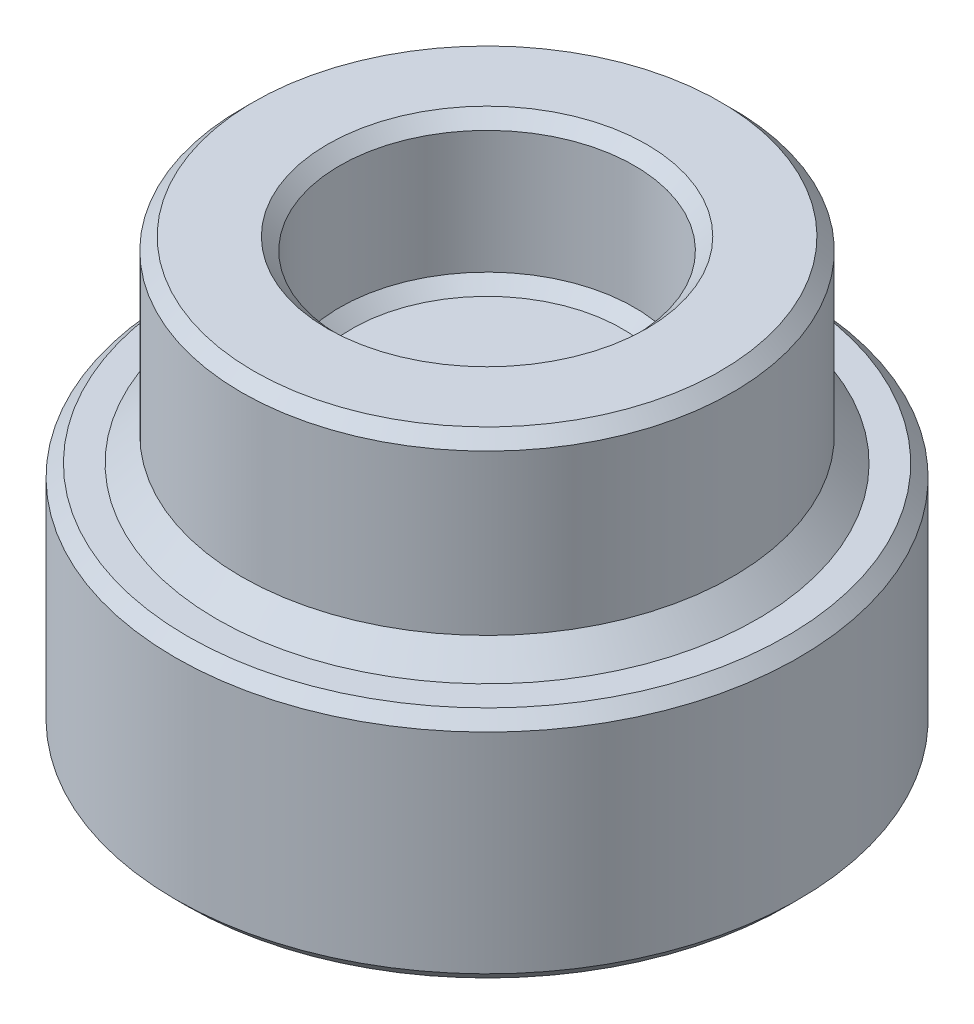
ISO-10303-21;
HEADER;
FILE_DESCRIPTION(('STEP AP214'),'2;1');
FILE_NAME('part.step','',(''),(''),'','','');
FILE_SCHEMA(('AUTOMOTIVE_DESIGN { 1 0 10303 214 1 1 1 1 }'));
ENDSEC;
DATA;
#1=APPLICATION_CONTEXT('core data for automotive mechanical design processes');
#2=APPLICATION_PROTOCOL_DEFINITION('international standard','automotive_design',2000,#1);
#3=PRODUCT_CONTEXT('',#1,'mechanical');
#4=PRODUCT('Part','Part','',(#3));
#5=PRODUCT_RELATED_PRODUCT_CATEGORY('part','',(#4));
#6=PRODUCT_DEFINITION_FORMATION('','',#4);
#7=PRODUCT_DEFINITION_CONTEXT('part definition',#1,'design');
#8=PRODUCT_DEFINITION('design','',#6,#7);
#9=PRODUCT_DEFINITION_SHAPE('','',#8);
#10=(LENGTH_UNIT() NAMED_UNIT(*) SI_UNIT(.MILLI.,.METRE.));
#11=(NAMED_UNIT(*) PLANE_ANGLE_UNIT() SI_UNIT($,.RADIAN.));
#12=(NAMED_UNIT(*) SI_UNIT($,.STERADIAN.) SOLID_ANGLE_UNIT());
#13=UNCERTAINTY_MEASURE_WITH_UNIT(LENGTH_MEASURE(1.E-05),#10,'distance_accuracy_value','');
#14=(GEOMETRIC_REPRESENTATION_CONTEXT(3) GLOBAL_UNCERTAINTY_ASSIGNED_CONTEXT((#13)) GLOBAL_UNIT_ASSIGNED_CONTEXT((#10,
#11,#12)) REPRESENTATION_CONTEXT('',''));
#15=CARTESIAN_POINT('',(0.,0.,0.));
#16=DIRECTION('',(0.,0.,1.));
#17=DIRECTION('',(1.,0.,0.));
#18=AXIS2_PLACEMENT_3D('',#15,#16,#17);
#19=CARTESIAN_POINT('',(0.,1.,0.));
#20=DIRECTION('',(0.,-1.,0.));
#21=DIRECTION('',(0.,0.,-1.));
#22=AXIS2_PLACEMENT_3D('',#19,#20,#21);
#23=CYLINDRICAL_SURFACE('',#22,5.);
#24=CARTESIAN_POINT('',(0.,0.500000000000003,0.));
#25=DIRECTION('',(0.,1.,0.));
#26=DIRECTION('',(0.,0.,1.));
#27=AXIS2_PLACEMENT_3D('',#24,#25,#26);
#28=CIRCLE('',#27,5.);
#29=CARTESIAN_POINT('',(0.,0.500000000000003,5.));
#30=VERTEX_POINT('',#29);
#31=EDGE_CURVE('E69',#30,#30,#28,.T.);
#32=ORIENTED_EDGE('',*,*,#31,.T.);
#33=EDGE_LOOP('',(#32));
#34=FACE_BOUND('',#33,.T.);
#35=CARTESIAN_POINT('',(0.,3.75,0.));
#36=DIRECTION('',(0.,1.,0.));
#37=DIRECTION('',(0.,0.,1.));
#38=AXIS2_PLACEMENT_3D('',#35,#36,#37);
#39=CIRCLE('',#38,5.);
#40=CARTESIAN_POINT('',(0.,3.75,5.));
#41=VERTEX_POINT('',#40);
#42=EDGE_CURVE('E101',#41,#41,#39,.F.);
#43=ORIENTED_EDGE('',*,*,#42,.T.);
#44=EDGE_LOOP('',(#43));
#45=FACE_BOUND('',#44,.T.);
#46=ADVANCED_FACE('F61',(#34,#45),#23,.T.);
#47=CARTESIAN_POINT('',(0.,4.,0.));
#48=DIRECTION('',(0.,1.,0.));
#49=DIRECTION('',(0.,0.,1.));
#50=AXIS2_PLACEMENT_3D('',#47,#48,#49);
#51=PLANE('',#50);
#52=CARTESIAN_POINT('',(0.,4.,0.));
#53=DIRECTION('',(0.,1.,0.));
#54=DIRECTION('',(0.,0.,1.));
#55=AXIS2_PLACEMENT_3D('',#52,#53,#54);
#56=CIRCLE('',#55,3.25);
#57=CARTESIAN_POINT('',(0.,4.,3.25));
#58=VERTEX_POINT('',#57);
#59=EDGE_CURVE('E98',#58,#58,#56,.F.);
#60=ORIENTED_EDGE('',*,*,#59,.T.);
#61=EDGE_LOOP('',(#60));
#62=FACE_BOUND('',#61,.T.);
#63=CARTESIAN_POINT('',(0.,4.,0.));
#64=DIRECTION('',(0.,1.,0.));
#65=DIRECTION('',(0.,0.,1.));
#66=AXIS2_PLACEMENT_3D('',#63,#64,#65);
#67=CIRCLE('',#66,4.75);
#68=CARTESIAN_POINT('',(0.,4.,4.75));
#69=VERTEX_POINT('',#68);
#70=EDGE_CURVE('E95',#69,#69,#67,.T.);
#71=ORIENTED_EDGE('',*,*,#70,.T.);
#72=EDGE_LOOP('',(#71));
#73=FACE_BOUND('',#72,.T.);
#74=ADVANCED_FACE('F134',(#62,#73),#51,.T.);
#75=CARTESIAN_POINT('',(0.,4.,0.));
#76=DIRECTION('',(0.,-1.,0.));
#77=DIRECTION('',(0.,0.,-1.));
#78=AXIS2_PLACEMENT_3D('',#75,#76,#77);
#79=CYLINDRICAL_SURFACE('',#78,3.);
#80=CARTESIAN_POINT('',(0.,3.75,0.));
#81=DIRECTION('',(0.,1.,0.));
#82=DIRECTION('',(0.,0.,1.));
#83=AXIS2_PLACEMENT_3D('',#80,#81,#82);
#84=CIRCLE('',#83,3.);
#85=CARTESIAN_POINT('',(0.,3.75,3.));
#86=VERTEX_POINT('',#85);
#87=EDGE_CURVE('E86',#86,#86,#84,.T.);
#88=ORIENTED_EDGE('',*,*,#87,.T.);
#89=EDGE_LOOP('',(#88));
#90=FACE_BOUND('',#89,.T.);
#91=CARTESIAN_POINT('',(0.,1.25,0.));
#92=DIRECTION('',(0.,1.,0.));
#93=DIRECTION('',(0.,0.,1.));
#94=AXIS2_PLACEMENT_3D('',#91,#92,#93);
#95=CIRCLE('',#94,3.);
#96=CARTESIAN_POINT('',(0.,1.25,3.));
#97=VERTEX_POINT('',#96);
#98=EDGE_CURVE('E82',#97,#97,#95,.F.);
#99=ORIENTED_EDGE('',*,*,#98,.T.);
#100=EDGE_LOOP('',(#99));
#101=FACE_BOUND('',#100,.T.);
#102=ADVANCED_FACE('F139',(#90,#101),#79,.F.);
#103=CARTESIAN_POINT('',(0.,1.,0.));
#104=DIRECTION('',(0.,1.,0.));
#105=DIRECTION('',(0.,0.,1.));
#106=AXIS2_PLACEMENT_3D('',#103,#104,#105);
#107=PLANE('',#106);
#108=CARTESIAN_POINT('',(0.,1.,0.));
#109=DIRECTION('',(0.,1.,0.));
#110=DIRECTION('',(0.,0.,1.));
#111=AXIS2_PLACEMENT_3D('',#108,#109,#110);
#112=CIRCLE('',#111,2.75);
#113=CARTESIAN_POINT('',(0.,1.,2.75));
#114=VERTEX_POINT('',#113);
#115=EDGE_CURVE('E104',#114,#114,#112,.T.);
#116=ORIENTED_EDGE('',*,*,#115,.T.);
#117=EDGE_LOOP('',(#116));
#118=FACE_BOUND('',#117,.T.);
#119=ADVANCED_FACE('F144',(#118),#107,.T.);
#120=CARTESIAN_POINT('',(0.,3.75,0.));
#121=DIRECTION('',(0.,1.,0.));
#122=DIRECTION('',(0.,0.,1.));
#123=AXIS2_PLACEMENT_3D('',#120,#121,#122);
#124=CONICAL_SURFACE('',#123,3.,0.785398163397455);
#125=ORIENTED_EDGE('',*,*,#59,.F.);
#126=EDGE_LOOP('',(#125));
#127=FACE_BOUND('',#126,.T.);
#128=ORIENTED_EDGE('',*,*,#87,.F.);
#129=EDGE_LOOP('',(#128));
#130=FACE_BOUND('',#129,.T.);
#131=ADVANCED_FACE('F146',(#127,#130),#124,.F.);
#132=CARTESIAN_POINT('',(0.,4.,0.));
#133=DIRECTION('',(0.,-1.,0.));
#134=DIRECTION('',(0.,0.,-1.));
#135=AXIS2_PLACEMENT_3D('',#132,#133,#134);
#136=CONICAL_SURFACE('',#135,4.75,0.785398163397441);
#137=ORIENTED_EDGE('',*,*,#42,.F.);
#138=EDGE_LOOP('',(#137));
#139=FACE_BOUND('',#138,.T.);
#140=ORIENTED_EDGE('',*,*,#70,.F.);
#141=EDGE_LOOP('',(#140));
#142=FACE_BOUND('',#141,.T.);
#143=ADVANCED_FACE('F152',(#139,#142),#136,.T.);
#144=CARTESIAN_POINT('',(0.,1.25,0.));
#145=DIRECTION('',(0.,1.,0.));
#146=DIRECTION('',(0.,0.,1.));
#147=AXIS2_PLACEMENT_3D('',#144,#145,#146);
#148=CONICAL_SURFACE('',#147,3.,0.785398163397443);
#149=ORIENTED_EDGE('',*,*,#115,.F.);
#150=EDGE_LOOP('',(#149));
#151=FACE_BOUND('',#150,.T.);
#152=ORIENTED_EDGE('',*,*,#98,.F.);
#153=EDGE_LOOP('',(#152));
#154=FACE_BOUND('',#153,.T.);
#155=ADVANCED_FACE('F159',(#151,#154),#148,.F.);
#156=CARTESIAN_POINT('',(0.,-4.7625,0.));
#157=DIRECTION('',(0.,1.,0.));
#158=DIRECTION('',(0.,0.,1.));
#159=AXIS2_PLACEMENT_3D('',#156,#157,#158);
#160=CYLINDRICAL_SURFACE('',#159,6.35);
#161=CARTESIAN_POINT('',(0.,-4.51249999999999,0.));
#162=DIRECTION('',(0.,1.,0.));
#163=DIRECTION('',(0.,0.,1.));
#164=AXIS2_PLACEMENT_3D('',#161,#162,#163);
#165=CIRCLE('',#164,6.35);
#166=CARTESIAN_POINT('',(0.,-4.51249999999999,6.35));
#167=VERTEX_POINT('',#166);
#168=EDGE_CURVE('E110',#167,#167,#165,.T.);
#169=CARTESIAN_POINT('',(0.,-0.249999999999988,0.));
#170=DIRECTION('',(0.,1.,0.));
#171=DIRECTION('',(0.,0.,1.));
#172=AXIS2_PLACEMENT_3D('',#169,#170,#171);
#173=CIRCLE('',#172,6.35);
#174=CARTESIAN_POINT('',(0.,-0.249999999999988,6.35));
#175=VERTEX_POINT('',#174);
#176=EDGE_CURVE('E107',#175,#175,#173,.F.);
#177=CARTESIAN_POINT('',(0.,-4.51249999999999,6.35));
#178=CARTESIAN_POINT('',(0.,-4.46809895833333,6.35));
#179=CARTESIAN_POINT('',(0.,-4.42369791666666,6.35));
#180=CARTESIAN_POINT('',(0.,-4.33489583333333,6.35));
#181=CARTESIAN_POINT('',(0.,-4.29049479166666,6.35));
#182=CARTESIAN_POINT('',(0.,-4.20169270833333,6.35));
#183=CARTESIAN_POINT('',(0.,-4.15729166666666,6.35));
#184=CARTESIAN_POINT('',(0.,-4.06848958333333,6.35));
#185=CARTESIAN_POINT('',(0.,-4.02408854166666,6.35));
#186=CARTESIAN_POINT('',(0.,-3.93528645833333,6.35));
#187=CARTESIAN_POINT('',(0.,-3.89088541666666,6.35));
#188=CARTESIAN_POINT('',(0.,-3.80208333333333,6.35));
#189=CARTESIAN_POINT('',(0.,-3.75768229166666,6.35));
#190=CARTESIAN_POINT('',(0.,-3.66888020833333,6.35));
#191=CARTESIAN_POINT('',(0.,-3.62447916666666,6.35));
#192=CARTESIAN_POINT('',(0.,-3.53567708333333,6.35));
#193=CARTESIAN_POINT('',(0.,-3.49127604166666,6.35));
#194=CARTESIAN_POINT('',(0.,-3.40247395833333,6.35));
#195=CARTESIAN_POINT('',(0.,-3.35807291666666,6.35));
#196=CARTESIAN_POINT('',(0.,-3.26927083333333,6.35));
#197=CARTESIAN_POINT('',(0.,-3.22486979166666,6.35));
#198=CARTESIAN_POINT('',(0.,-3.13606770833333,6.35));
#199=CARTESIAN_POINT('',(0.,-3.09166666666666,6.35));
#200=CARTESIAN_POINT('',(0.,-3.00286458333333,6.35));
#201=CARTESIAN_POINT('',(0.,-2.95846354166666,6.35));
#202=CARTESIAN_POINT('',(0.,-2.86966145833333,6.35));
#203=CARTESIAN_POINT('',(0.,-2.82526041666666,6.35));
#204=CARTESIAN_POINT('',(0.,-2.73645833333333,6.35));
#205=CARTESIAN_POINT('',(0.,-2.69205729166666,6.35));
#206=CARTESIAN_POINT('',(0.,-2.60325520833333,6.35));
#207=CARTESIAN_POINT('',(0.,-2.55885416666666,6.35));
#208=CARTESIAN_POINT('',(0.,-2.47005208333333,6.35));
#209=CARTESIAN_POINT('',(0.,-2.42565104166666,6.35));
#210=CARTESIAN_POINT('',(0.,-2.33684895833333,6.35));
#211=CARTESIAN_POINT('',(0.,-2.29244791666666,6.35));
#212=CARTESIAN_POINT('',(0.,-2.20364583333332,6.35));
#213=CARTESIAN_POINT('',(0.,-2.15924479166666,6.35));
#214=CARTESIAN_POINT('',(0.,-2.07044270833332,6.35));
#215=CARTESIAN_POINT('',(0.,-2.02604166666666,6.35));
#216=CARTESIAN_POINT('',(0.,-1.93723958333332,6.35));
#217=CARTESIAN_POINT('',(0.,-1.89283854166666,6.35));
#218=CARTESIAN_POINT('',(0.,-1.80403645833332,6.35));
#219=CARTESIAN_POINT('',(0.,-1.75963541666666,6.35));
#220=CARTESIAN_POINT('',(0.,-1.67083333333332,6.35));
#221=CARTESIAN_POINT('',(0.,-1.62643229166666,6.35));
#222=CARTESIAN_POINT('',(0.,-1.53763020833332,6.35));
#223=CARTESIAN_POINT('',(0.,-1.49322916666666,6.35));
#224=CARTESIAN_POINT('',(0.,-1.40442708333332,6.35));
#225=CARTESIAN_POINT('',(0.,-1.36002604166666,6.35));
#226=CARTESIAN_POINT('',(0.,-1.27122395833332,6.35));
#227=CARTESIAN_POINT('',(0.,-1.22682291666666,6.35));
#228=CARTESIAN_POINT('',(0.,-1.13802083333332,6.35));
#229=CARTESIAN_POINT('',(0.,-1.09361979166666,6.35));
#230=CARTESIAN_POINT('',(0.,-1.00481770833332,6.35));
#231=CARTESIAN_POINT('',(0.,-0.960416666666656,6.35));
#232=CARTESIAN_POINT('',(0.,-0.871614583333323,6.35));
#233=CARTESIAN_POINT('',(0.,-0.827213541666656,6.35));
#234=CARTESIAN_POINT('',(0.,-0.738411458333323,6.35));
#235=CARTESIAN_POINT('',(0.,-0.694010416666656,6.35));
#236=CARTESIAN_POINT('',(0.,-0.605208333333322,6.35));
#237=CARTESIAN_POINT('',(0.,-0.560807291666655,6.35));
#238=CARTESIAN_POINT('',(0.,-0.472005208333322,6.35));
#239=CARTESIAN_POINT('',(0.,-0.427604166666655,6.35));
#240=CARTESIAN_POINT('',(0.,-0.338802083333321,6.35));
#241=CARTESIAN_POINT('',(0.,-0.294401041666655,6.35));
#242=CARTESIAN_POINT('',(0.,-0.249999999999988,6.35));
#243=B_SPLINE_CURVE_WITH_KNOTS('',3,(#177,#178,#179,#180,#181,#182,#183,#184,#185,#186,#187,
#188,#189,#190,#191,#192,#193,#194,#195,#196,#197,#198,#199,#200,#201,#202,#203,#204,#205,#206,
#207,#208,#209,#210,#211,#212,#213,#214,#215,#216,#217,#218,#219,#220,#221,#222,#223,#224,#225,
#226,#227,#228,#229,#230,#231,#232,#233,#234,#235,#236,#237,#238,#239,#240,#241,#242),
.UNSPECIFIED.,.F.,.F.,(4,2,2,2,2,2,2,2,2,2,2,2,2,2,2,2,2,2,2,2,2,2,2,2,2,2,2,2,2,2,2,2,4),(0.,
0.133203125,0.26640625,0.399609375,0.5328125,0.666015625000001,0.799218750000001,
0.932421875000001,1.065625,1.198828125,1.33203125,1.465234375,1.5984375,1.731640625,1.86484375,
1.998046875,2.13125,2.264453125,2.39765625,2.530859375,2.6640625,2.797265625,2.93046875,
3.063671875,3.196875,3.330078125,3.46328125000001,3.59648437500001,3.72968750000001,
3.86289062500001,3.99609375000001,4.12929687500001,4.26250000000001),.UNSPECIFIED.);
#244=EDGE_CURVE('BSEAM166',#167,#175,#243,.T.);
#245=ORIENTED_EDGE('',*,*,#168,.T.);
#246=ORIENTED_EDGE('',*,*,#176,.T.);
#247=ORIENTED_EDGE('',*,*,#244,.T.);
#248=ORIENTED_EDGE('',*,*,#244,.F.);
#249=EDGE_LOOP('',(#245,#247,#246,#248));
#250=FACE_BOUND('',#249,.T.);
#251=ADVANCED_FACE('F166',(#250),#160,.T.);
#252=CARTESIAN_POINT('',(0.,-4.7625,0.));
#253=DIRECTION('',(0.,1.,0.));
#254=DIRECTION('',(0.,0.,1.));
#255=AXIS2_PLACEMENT_3D('',#252,#253,#254);
#256=PLANE('',#255);
#257=CARTESIAN_POINT('',(0.,-4.7625,0.));
#258=DIRECTION('',(0.,1.,0.));
#259=DIRECTION('',(0.,0.,1.));
#260=AXIS2_PLACEMENT_3D('',#257,#258,#259);
#261=CIRCLE('',#260,6.1);
#262=CARTESIAN_POINT('',(0.,-4.7625,6.1));
#263=VERTEX_POINT('',#262);
#264=EDGE_CURVE('E113',#263,#263,#261,.F.);
#265=ORIENTED_EDGE('',*,*,#264,.T.);
#266=EDGE_LOOP('',(#265));
#267=FACE_BOUND('',#266,.T.);
#268=CARTESIAN_POINT('',(0.,-4.7625,0.));
#269=DIRECTION('',(0.,-1.,0.));
#270=DIRECTION('',(0.,0.,-1.));
#271=AXIS2_PLACEMENT_3D('',#268,#269,#270);
#272=CIRCLE('',#271,4.09575);
#273=CARTESIAN_POINT('',(0.,-4.7625,-4.09575));
#274=VERTEX_POINT('',#273);
#275=EDGE_CURVE('E89',#274,#274,#272,.T.);
#276=ORIENTED_EDGE('',*,*,#275,.F.);
#277=EDGE_LOOP('',(#276));
#278=FACE_BOUND('',#277,.T.);
#279=ADVANCED_FACE('F190',(#267,#278),#256,.F.);
#280=CARTESIAN_POINT('',(0.,0.,0.));
#281=DIRECTION('',(0.,1.,0.));
#282=DIRECTION('',(0.,0.,1.));
#283=AXIS2_PLACEMENT_3D('',#280,#281,#282);
#284=PLANE('',#283);
#285=CARTESIAN_POINT('',(0.,0.,0.));
#286=DIRECTION('',(0.,1.,0.));
#287=DIRECTION('',(0.,0.,1.));
#288=AXIS2_PLACEMENT_3D('',#285,#286,#287);
#289=CIRCLE('',#288,5.5);
#290=CARTESIAN_POINT('',(0.,0.,5.5));
#291=VERTEX_POINT('',#290);
#292=EDGE_CURVE('E12',#291,#291,#289,.F.);
#293=ORIENTED_EDGE('',*,*,#292,.T.);
#294=EDGE_LOOP('',(#293));
#295=FACE_BOUND('',#294,.T.);
#296=CARTESIAN_POINT('',(0.,0.,0.));
#297=DIRECTION('',(0.,1.,0.));
#298=DIRECTION('',(0.,0.,1.));
#299=AXIS2_PLACEMENT_3D('',#296,#297,#298);
#300=CIRCLE('',#299,6.10000000000001);
#301=CARTESIAN_POINT('',(0.,0.,6.10000000000001));
#302=VERTEX_POINT('',#301);
#303=EDGE_CURVE('E116',#302,#302,#300,.T.);
#304=ORIENTED_EDGE('',*,*,#303,.T.);
#305=EDGE_LOOP('',(#304));
#306=FACE_BOUND('',#305,.T.);
#307=ADVANCED_FACE('F76',(#295,#306),#284,.T.);
#308=CARTESIAN_POINT('',(0.,-0.347220633368511,0.));
#309=DIRECTION('',(0.,-1.,0.));
#310=DIRECTION('',(0.,0.,-1.));
#311=AXIS2_PLACEMENT_3D('',#308,#309,#310);
#312=CONICAL_SURFACE('',#311,3.96875,1.48352986419518);
#313=CARTESIAN_POINT('',(0.,0.,0.));
#314=VERTEX_POINT('',#313);
#315=VERTEX_LOOP('',#314);
#316=FACE_BOUND('',#315,.T.);
#317=CARTESIAN_POINT('',(0.,-0.347220633368511,0.));
#318=DIRECTION('',(0.,-1.,0.));
#319=DIRECTION('',(0.,0.,-1.));
#320=AXIS2_PLACEMENT_3D('',#317,#318,#319);
#321=CIRCLE('',#320,3.96875);
#322=CARTESIAN_POINT('',(0.,-0.347220633368511,-3.96875));
#323=VERTEX_POINT('',#322);
#324=EDGE_CURVE('E80',#323,#323,#321,.T.);
#325=ORIENTED_EDGE('',*,*,#324,.T.);
#326=EDGE_LOOP('',(#325));
#327=FACE_BOUND('',#326,.T.);
#328=ADVANCED_FACE('F72',(#316,#327),#312,.F.);
#329=CARTESIAN_POINT('',(0.,-4.7625,0.));
#330=DIRECTION('',(0.,-1.,0.));
#331=DIRECTION('',(0.,0.,-1.));
#332=AXIS2_PLACEMENT_3D('',#329,#330,#331);
#333=CYLINDRICAL_SURFACE('',#332,3.96875);
#334=ORIENTED_EDGE('',*,*,#324,.F.);
#335=EDGE_LOOP('',(#334));
#336=FACE_BOUND('',#335,.T.);
#337=CARTESIAN_POINT('',(0.,-4.6355,0.));
#338=DIRECTION('',(0.,-1.,0.));
#339=DIRECTION('',(0.,0.,-1.));
#340=AXIS2_PLACEMENT_3D('',#337,#338,#339);
#341=CIRCLE('',#340,3.96875);
#342=CARTESIAN_POINT('',(0.,-4.6355,-3.96875));
#343=VERTEX_POINT('',#342);
#344=EDGE_CURVE('E83',#343,#343,#341,.T.);
#345=ORIENTED_EDGE('',*,*,#344,.T.);
#346=EDGE_LOOP('',(#345));
#347=FACE_BOUND('',#346,.T.);
#348=ADVANCED_FACE('F75',(#336,#347),#333,.F.);
#349=CARTESIAN_POINT('',(0.,-4.7625,0.));
#350=DIRECTION('',(0.,-1.,0.));
#351=DIRECTION('',(0.,0.,-1.));
#352=AXIS2_PLACEMENT_3D('',#349,#350,#351);
#353=CONICAL_SURFACE('',#352,4.09575,0.785398163397445);
#354=ORIENTED_EDGE('',*,*,#344,.F.);
#355=EDGE_LOOP('',(#354));
#356=FACE_BOUND('',#355,.T.);
#357=ORIENTED_EDGE('',*,*,#275,.T.);
#358=EDGE_LOOP('',(#357));
#359=FACE_BOUND('',#358,.T.);
#360=ADVANCED_FACE('F172',(#356,#359),#353,.F.);
#361=CARTESIAN_POINT('',(0.,-4.51249999999999,0.));
#362=DIRECTION('',(0.,1.,0.));
#363=DIRECTION('',(0.,0.,1.));
#364=AXIS2_PLACEMENT_3D('',#361,#362,#363);
#365=CONICAL_SURFACE('',#364,6.35,0.785398163397447);
#366=ORIENTED_EDGE('',*,*,#264,.F.);
#367=EDGE_LOOP('',(#366));
#368=FACE_BOUND('',#367,.T.);
#369=ORIENTED_EDGE('',*,*,#168,.F.);
#370=EDGE_LOOP('',(#369));
#371=FACE_BOUND('',#370,.T.);
#372=ADVANCED_FACE('F130',(#368,#371),#365,.T.);
#373=CARTESIAN_POINT('',(0.,0.,0.));
#374=DIRECTION('',(0.,-1.,0.));
#375=DIRECTION('',(0.,0.,-1.));
#376=AXIS2_PLACEMENT_3D('',#373,#374,#375);
#377=CONICAL_SURFACE('',#376,6.10000000000001,0.78539816339745);
#378=ORIENTED_EDGE('',*,*,#176,.F.);
#379=EDGE_LOOP('',(#378));
#380=FACE_BOUND('',#379,.T.);
#381=ORIENTED_EDGE('',*,*,#303,.F.);
#382=EDGE_LOOP('',(#381));
#383=FACE_BOUND('',#382,.T.);
#384=ADVANCED_FACE('F124',(#380,#383),#377,.T.);
#385=CARTESIAN_POINT('',(0.,0.500000000000003,0.));
#386=DIRECTION('',(0.,-1.,0.));
#387=DIRECTION('',(0.,0.,-1.));
#388=AXIS2_PLACEMENT_3D('',#385,#386,#387);
#389=CONICAL_SURFACE('',#388,5.,0.785398163397441);
#390=ORIENTED_EDGE('',*,*,#292,.F.);
#391=EDGE_LOOP('',(#390));
#392=FACE_BOUND('',#391,.T.);
#393=ORIENTED_EDGE('',*,*,#31,.F.);
#394=EDGE_LOOP('',(#393));
#395=FACE_BOUND('',#394,.T.);
#396=ADVANCED_FACE('F64',(#392,#395),#389,.T.);
#397=CLOSED_SHELL('',(#46,#74,#102,#119,#131,#143,#155,#251,#279,#307,#328,#348,#360,#372,#384,#396));
#398=MANIFOLD_SOLID_BREP('B2',#397);
#399=ADVANCED_BREP_SHAPE_REPRESENTATION('',(#18,#398),#14);
#400=SHAPE_DEFINITION_REPRESENTATION(#9,#399);
ENDSEC;
END-ISO-10303-21;
